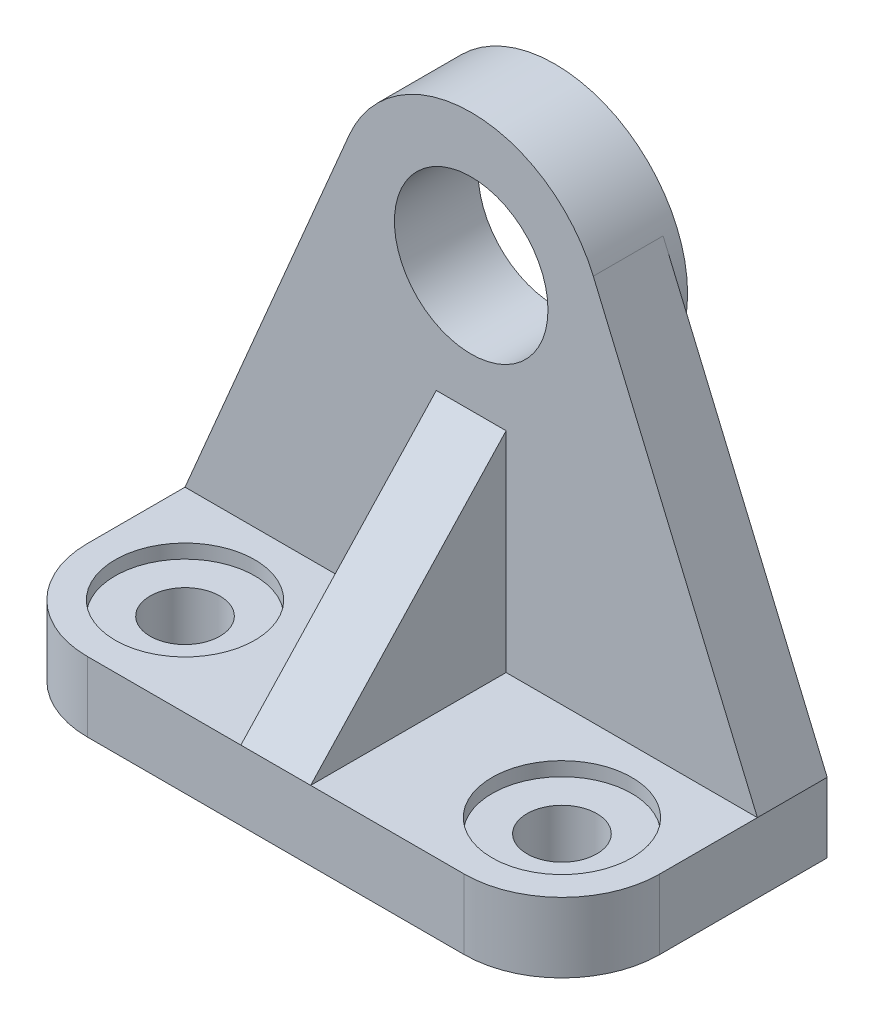
ISO-10303-21;
HEADER;
FILE_DESCRIPTION(('STEP AP214'),'2;1');
FILE_NAME('part.step','',(''),(''),'','','');
FILE_SCHEMA(('AUTOMOTIVE_DESIGN { 1 0 10303 214 1 1 1 1 }'));
ENDSEC;
DATA;
#1=APPLICATION_CONTEXT('core data for automotive mechanical design processes');
#2=APPLICATION_PROTOCOL_DEFINITION('international standard','automotive_design',2000,#1);
#3=PRODUCT_CONTEXT('',#1,'mechanical');
#4=PRODUCT('Part','Part','',(#3));
#5=PRODUCT_RELATED_PRODUCT_CATEGORY('part','',(#4));
#6=PRODUCT_DEFINITION_FORMATION('','',#4);
#7=PRODUCT_DEFINITION_CONTEXT('part definition',#1,'design');
#8=PRODUCT_DEFINITION('design','',#6,#7);
#9=PRODUCT_DEFINITION_SHAPE('','',#8);
#10=(LENGTH_UNIT() NAMED_UNIT(*) SI_UNIT(.MILLI.,.METRE.));
#11=(NAMED_UNIT(*) PLANE_ANGLE_UNIT() SI_UNIT($,.RADIAN.));
#12=(NAMED_UNIT(*) SI_UNIT($,.STERADIAN.) SOLID_ANGLE_UNIT());
#13=UNCERTAINTY_MEASURE_WITH_UNIT(LENGTH_MEASURE(1.E-05),#10,'distance_accuracy_value','');
#14=(GEOMETRIC_REPRESENTATION_CONTEXT(3) GLOBAL_UNCERTAINTY_ASSIGNED_CONTEXT((#13)) GLOBAL_UNIT_ASSIGNED_CONTEXT((#10,
#11,#12)) REPRESENTATION_CONTEXT('',''));
#15=CARTESIAN_POINT('',(0.,0.,0.));
#16=DIRECTION('',(0.,0.,1.));
#17=DIRECTION('',(1.,0.,0.));
#18=AXIS2_PLACEMENT_3D('',#15,#16,#17);
#19=CARTESIAN_POINT('',(27.,77.001,-14.));
#20=DIRECTION('',(0.,-1.,0.));
#21=DIRECTION('',(0.,0.,-1.));
#22=AXIS2_PLACEMENT_3D('',#19,#20,#21);
#23=CYLINDRICAL_SURFACE('',#22,5.);
#24=CARTESIAN_POINT('',(27.,0.,-14.));
#25=DIRECTION('',(0.,1.,0.));
#26=DIRECTION('',(0.,0.,1.));
#27=AXIS2_PLACEMENT_3D('',#24,#25,#26);
#28=CIRCLE('',#27,5.);
#29=CARTESIAN_POINT('',(27.,0.,-9.00000000000001));
#30=VERTEX_POINT('',#29);
#31=EDGE_CURVE('E243',#30,#30,#28,.T.);
#32=ORIENTED_EDGE('',*,*,#31,.F.);
#33=EDGE_LOOP('',(#32));
#34=FACE_BOUND('',#33,.T.);
#35=CARTESIAN_POINT('',(27.,7.99999999999999,-14.));
#36=DIRECTION('',(0.,1.,0.));
#37=DIRECTION('',(0.,0.,1.));
#38=AXIS2_PLACEMENT_3D('',#35,#36,#37);
#39=CIRCLE('',#38,5.);
#40=CARTESIAN_POINT('',(27.,7.99999999999999,-9.00000000000001));
#41=VERTEX_POINT('',#40);
#42=EDGE_CURVE('E67',#41,#41,#39,.T.);
#43=ORIENTED_EDGE('',*,*,#42,.T.);
#44=EDGE_LOOP('',(#43));
#45=FACE_BOUND('',#44,.T.);
#46=ADVANCED_FACE('F63',(#34,#45),#23,.F.);
#47=CARTESIAN_POINT('',(-27.,77.001,-14.));
#48=DIRECTION('',(0.,-1.,0.));
#49=DIRECTION('',(0.,0.,-1.));
#50=AXIS2_PLACEMENT_3D('',#47,#48,#49);
#51=CYLINDRICAL_SURFACE('',#50,5.);
#52=CARTESIAN_POINT('',(-27.,0.,-14.));
#53=DIRECTION('',(0.,1.,0.));
#54=DIRECTION('',(0.,0.,1.));
#55=AXIS2_PLACEMENT_3D('',#52,#53,#54);
#56=CIRCLE('',#55,5.);
#57=CARTESIAN_POINT('',(-27.,0.,-9.));
#58=VERTEX_POINT('',#57);
#59=EDGE_CURVE('E260',#58,#58,#56,.T.);
#60=ORIENTED_EDGE('',*,*,#59,.F.);
#61=EDGE_LOOP('',(#60));
#62=FACE_BOUND('',#61,.T.);
#63=CARTESIAN_POINT('',(-27.,7.99999999999999,-14.));
#64=DIRECTION('',(0.,1.,0.));
#65=DIRECTION('',(0.,0.,1.));
#66=AXIS2_PLACEMENT_3D('',#63,#64,#65);
#67=CIRCLE('',#66,5.);
#68=CARTESIAN_POINT('',(-27.,7.99999999999999,-9.));
#69=VERTEX_POINT('',#68);
#70=EDGE_CURVE('E237',#69,#69,#67,.T.);
#71=ORIENTED_EDGE('',*,*,#70,.T.);
#72=EDGE_LOOP('',(#71));
#73=FACE_BOUND('',#72,.T.);
#74=ADVANCED_FACE('F326',(#62,#73),#51,.F.);
#75=CARTESIAN_POINT('',(41.,10.,0.));
#76=DIRECTION('',(0.,-1.,0.));
#77=DIRECTION('',(0.,0.,-1.));
#78=AXIS2_PLACEMENT_3D('',#75,#76,#77);
#79=PLANE('',#78);
#80=CARTESIAN_POINT('',(-27.,10.,-14.));
#81=DIRECTION('',(0.,1.,0.));
#82=DIRECTION('',(0.,0.,1.));
#83=AXIS2_PLACEMENT_3D('',#80,#81,#82);
#84=CIRCLE('',#83,10.);
#85=CARTESIAN_POINT('',(-27.,10.,-4.));
#86=VERTEX_POINT('',#85);
#87=EDGE_CURVE('E245',#86,#86,#84,.T.);
#88=ORIENTED_EDGE('',*,*,#87,.F.);
#89=EDGE_LOOP('',(#88));
#90=FACE_BOUND('',#89,.T.);
#91=DIRECTION('',(0.,0.,1.));
#92=VECTOR('',#91,1.);
#93=CARTESIAN_POINT('',(-41.,10.,0.));
#94=LINE('',#93,#92);
#95=CARTESIAN_POINT('',(-41.,10.,-28.));
#96=VERTEX_POINT('',#95);
#97=CARTESIAN_POINT('',(-41.,10.,-14.));
#98=VERTEX_POINT('',#97);
#99=EDGE_CURVE('E197',#96,#98,#94,.T.);
#100=ORIENTED_EDGE('',*,*,#99,.T.);
#101=CARTESIAN_POINT('',(-27.,10.,-14.));
#102=DIRECTION('',(0.,-1.,0.));
#103=DIRECTION('',(0.,0.,-1.));
#104=AXIS2_PLACEMENT_3D('',#101,#102,#103);
#105=CIRCLE('',#104,14.);
#106=CARTESIAN_POINT('',(-27.,10.,0.));
#107=VERTEX_POINT('',#106);
#108=EDGE_CURVE('E72',#98,#107,#105,.F.);
#109=ORIENTED_EDGE('',*,*,#108,.T.);
#110=DIRECTION('',(-1.,0.,0.));
#111=VECTOR('',#110,1.);
#112=CARTESIAN_POINT('',(41.,10.,0.));
#113=LINE('',#112,#111);
#114=CARTESIAN_POINT('',(-5.,10.,0.));
#115=VERTEX_POINT('',#114);
#116=EDGE_CURVE('E203',#115,#107,#113,.T.);
#117=ORIENTED_EDGE('',*,*,#116,.F.);
#118=DIRECTION('',(0.,0.,-1.));
#119=VECTOR('',#118,1.);
#120=CARTESIAN_POINT('',(-5.,10.,0.));
#121=LINE('',#120,#119);
#122=CARTESIAN_POINT('',(-5.,10.,-28.));
#123=VERTEX_POINT('',#122);
#124=EDGE_CURVE('E279',#115,#123,#121,.T.);
#125=ORIENTED_EDGE('',*,*,#124,.T.);
#126=DIRECTION('',(-1.,0.,0.));
#127=VECTOR('',#126,1.);
#128=CARTESIAN_POINT('',(41.,10.,-28.));
#129=LINE('',#128,#127);
#130=EDGE_CURVE('E209',#123,#96,#129,.T.);
#131=ORIENTED_EDGE('',*,*,#130,.T.);
#132=EDGE_LOOP('',(#100,#109,#117,#125,#131));
#133=FACE_BOUND('',#132,.T.);
#134=ADVANCED_FACE('F312',(#90,#133),#79,.F.);
#135=CARTESIAN_POINT('',(41.,0.,-38.));
#136=DIRECTION('',(0.,0.,1.));
#137=DIRECTION('',(1.,0.,0.));
#138=AXIS2_PLACEMENT_3D('',#135,#136,#137);
#139=PLANE('',#138);
#140=CARTESIAN_POINT('',(0.,58.0000000000387,-38.));
#141=DIRECTION('',(0.,0.,-1.));
#142=DIRECTION('',(-1.,0.,0.));
#143=AXIS2_PLACEMENT_3D('',#140,#141,#142);
#144=CIRCLE('',#143,19.);
#145=CARTESIAN_POINT('',(17.4913668780369,65.4197092083866,-38.));
#146=VERTEX_POINT('',#145);
#147=CARTESIAN_POINT('',(-17.4913668780726,65.4197092084017,-38.));
#148=VERTEX_POINT('',#147);
#149=EDGE_CURVE('E12',#146,#148,#144,.T.);
#150=ORIENTED_EDGE('',*,*,#149,.F.);
#151=DIRECTION('',(0.390511010966473,-0.920598256740661,0.));
#152=VECTOR('',#151,1.);
#153=CARTESIAN_POINT('',(44.5950375593377,1.52498849686057,-38.));
#154=LINE('',#153,#152);
#155=CARTESIAN_POINT('',(41.,10.,-38.));
#156=VERTEX_POINT('',#155);
#157=EDGE_CURVE('E184',#146,#156,#154,.T.);
#158=ORIENTED_EDGE('',*,*,#157,.T.);
#159=DIRECTION('',(0.,1.,0.));
#160=VECTOR('',#159,1.);
#161=CARTESIAN_POINT('',(41.,0.,-38.));
#162=LINE('',#161,#160);
#163=CARTESIAN_POINT('',(41.,0.,-38.));
#164=VERTEX_POINT('',#163);
#165=EDGE_CURVE('E196',#164,#156,#162,.T.);
#166=ORIENTED_EDGE('',*,*,#165,.F.);
#167=DIRECTION('',(-1.,0.,0.));
#168=VECTOR('',#167,1.);
#169=CARTESIAN_POINT('',(41.,0.,-38.));
#170=LINE('',#169,#168);
#171=CARTESIAN_POINT('',(-41.,0.,-38.));
#172=VERTEX_POINT('',#171);
#173=EDGE_CURVE('E213',#164,#172,#170,.T.);
#174=ORIENTED_EDGE('',*,*,#173,.T.);
#175=DIRECTION('',(0.,1.,0.));
#176=VECTOR('',#175,1.);
#177=CARTESIAN_POINT('',(-41.,0.,-38.));
#178=LINE('',#177,#176);
#179=CARTESIAN_POINT('',(-41.,10.,-38.));
#180=VERTEX_POINT('',#179);
#181=EDGE_CURVE('E162',#172,#180,#178,.T.);
#182=ORIENTED_EDGE('',*,*,#181,.T.);
#183=DIRECTION('',(0.390511010966473,0.920598256740661,0.));
#184=VECTOR('',#183,1.);
#185=CARTESIAN_POINT('',(-32.090131885081,31.0042964834295,-38.));
#186=LINE('',#185,#184);
#187=EDGE_CURVE('E155',#180,#148,#186,.T.);
#188=ORIENTED_EDGE('',*,*,#187,.T.);
#189=EDGE_LOOP('',(#150,#158,#166,#174,#182,#188));
#190=FACE_BOUND('',#189,.T.);
#191=ADVANCED_FACE('F157',(#190),#139,.F.);
#192=CARTESIAN_POINT('',(41.,10.,-28.));
#193=DIRECTION('',(0.,0.,-1.));
#194=DIRECTION('',(-1.,0.,0.));
#195=AXIS2_PLACEMENT_3D('',#192,#193,#194);
#196=PLANE('',#195);
#197=CARTESIAN_POINT('',(0.,58.0000000000387,-28.));
#198=DIRECTION('',(0.,0.,1.));
#199=DIRECTION('',(1.,0.,0.));
#200=AXIS2_PLACEMENT_3D('',#197,#198,#199);
#201=CIRCLE('',#200,10.9999999999887);
#202=CARTESIAN_POINT('',(10.9999999999887,58.0000000000387,-28.));
#203=VERTEX_POINT('',#202);
#204=EDGE_CURVE('E188',#203,#203,#201,.T.);
#205=ORIENTED_EDGE('',*,*,#204,.F.);
#206=EDGE_LOOP('',(#205));
#207=FACE_BOUND('',#206,.T.);
#208=DIRECTION('',(-1.,0.,0.));
#209=VECTOR('',#208,1.);
#210=CARTESIAN_POINT('',(5.,40.,-28.));
#211=LINE('',#210,#209);
#212=CARTESIAN_POINT('',(5.,40.,-28.));
#213=VERTEX_POINT('',#212);
#214=CARTESIAN_POINT('',(-5.,40.,-28.));
#215=VERTEX_POINT('',#214);
#216=EDGE_CURVE('E276',#213,#215,#211,.T.);
#217=ORIENTED_EDGE('',*,*,#216,.F.);
#218=DIRECTION('',(0.,1.,0.));
#219=VECTOR('',#218,1.);
#220=CARTESIAN_POINT('',(5.,10.,-28.));
#221=LINE('',#220,#219);
#222=CARTESIAN_POINT('',(5.,10.,-28.));
#223=VERTEX_POINT('',#222);
#224=EDGE_CURVE('E273',#223,#213,#221,.T.);
#225=ORIENTED_EDGE('',*,*,#224,.F.);
#226=CARTESIAN_POINT('',(41.,10.,-28.));
#227=VERTEX_POINT('',#226);
#228=EDGE_CURVE('E210',#227,#223,#129,.T.);
#229=ORIENTED_EDGE('',*,*,#228,.F.);
#230=DIRECTION('',(0.390511010966473,-0.920598256740661,0.));
#231=VECTOR('',#230,1.);
#232=CARTESIAN_POINT('',(38.3425847222094,16.264642490145,-28.));
#233=LINE('',#232,#231);
#234=CARTESIAN_POINT('',(17.4913668780369,65.4197092083866,-28.));
#235=VERTEX_POINT('',#234);
#236=EDGE_CURVE('E185',#235,#227,#233,.T.);
#237=ORIENTED_EDGE('',*,*,#236,.F.);
#238=CARTESIAN_POINT('',(0.,58.0000000000387,-28.));
#239=DIRECTION('',(0.,0.,1.));
#240=DIRECTION('',(1.,0.,0.));
#241=AXIS2_PLACEMENT_3D('',#238,#239,#240);
#242=CIRCLE('',#241,18.9999999999613);
#243=CARTESIAN_POINT('',(-17.4913668780369,65.4197092083866,-28.));
#244=VERTEX_POINT('',#243);
#245=EDGE_CURVE('E181',#235,#244,#242,.T.);
#246=ORIENTED_EDGE('',*,*,#245,.T.);
#247=DIRECTION('',(0.390511010966473,0.920598256740661,0.));
#248=VECTOR('',#247,1.);
#249=CARTESIAN_POINT('',(-38.3425847222094,16.264642490145,-28.));
#250=LINE('',#249,#248);
#251=EDGE_CURVE('E172',#96,#244,#250,.T.);
#252=ORIENTED_EDGE('',*,*,#251,.F.);
#253=ORIENTED_EDGE('',*,*,#130,.F.);
#254=DIRECTION('',(0.,1.,0.));
#255=VECTOR('',#254,1.);
#256=CARTESIAN_POINT('',(-5.,10.,-28.));
#257=LINE('',#256,#255);
#258=EDGE_CURVE('E270',#123,#215,#257,.T.);
#259=ORIENTED_EDGE('',*,*,#258,.T.);
#260=EDGE_LOOP('',(#217,#225,#229,#237,#246,#252,#253,#259));
#261=FACE_BOUND('',#260,.T.);
#262=ADVANCED_FACE('F291',(#207,#261),#196,.F.);
#263=CARTESIAN_POINT('',(41.,10.,0.));
#264=DIRECTION('',(0.,0.,-1.));
#265=DIRECTION('',(-1.,0.,0.));
#266=AXIS2_PLACEMENT_3D('',#263,#264,#265);
#267=PLANE('',#266);
#268=DIRECTION('',(-1.,0.,0.));
#269=VECTOR('',#268,1.);
#270=CARTESIAN_POINT('',(41.,0.,0.));
#271=LINE('',#270,#269);
#272=CARTESIAN_POINT('',(27.,0.,0.));
#273=VERTEX_POINT('',#272);
#274=CARTESIAN_POINT('',(-27.,0.,0.));
#275=VERTEX_POINT('',#274);
#276=EDGE_CURVE('E215',#273,#275,#271,.T.);
#277=ORIENTED_EDGE('',*,*,#276,.F.);
#278=DIRECTION('',(0.,-1.,0.));
#279=VECTOR('',#278,1.);
#280=CARTESIAN_POINT('',(27.,10.,0.));
#281=LINE('',#280,#279);
#282=CARTESIAN_POINT('',(27.,10.,0.));
#283=VERTEX_POINT('',#282);
#284=EDGE_CURVE('E232',#273,#283,#281,.F.);
#285=ORIENTED_EDGE('',*,*,#284,.T.);
#286=CARTESIAN_POINT('',(5.,10.,0.));
#287=VERTEX_POINT('',#286);
#288=EDGE_CURVE('E207',#283,#287,#113,.T.);
#289=ORIENTED_EDGE('',*,*,#288,.T.);
#290=DIRECTION('',(-1.,0.,0.));
#291=VECTOR('',#290,1.);
#292=CARTESIAN_POINT('',(5.,10.,0.));
#293=LINE('',#292,#291);
#294=EDGE_CURVE('E284',#287,#115,#293,.T.);
#295=ORIENTED_EDGE('',*,*,#294,.T.);
#296=ORIENTED_EDGE('',*,*,#116,.T.);
#297=DIRECTION('',(0.,-1.,0.));
#298=VECTOR('',#297,1.);
#299=CARTESIAN_POINT('',(-27.,10.,0.));
#300=LINE('',#299,#298);
#301=EDGE_CURVE('E229',#107,#275,#300,.T.);
#302=ORIENTED_EDGE('',*,*,#301,.T.);
#303=EDGE_LOOP('',(#277,#285,#289,#295,#296,#302));
#304=FACE_BOUND('',#303,.T.);
#305=ADVANCED_FACE('F294',(#304),#267,.F.);
#306=CARTESIAN_POINT('',(41.,0.,0.));
#307=DIRECTION('',(0.,1.,0.));
#308=DIRECTION('',(0.,0.,1.));
#309=AXIS2_PLACEMENT_3D('',#306,#307,#308);
#310=PLANE('',#309);
#311=ORIENTED_EDGE('',*,*,#59,.T.);
#312=EDGE_LOOP('',(#311));
#313=FACE_BOUND('',#312,.T.);
#314=ORIENTED_EDGE('',*,*,#31,.T.);
#315=EDGE_LOOP('',(#314));
#316=FACE_BOUND('',#315,.T.);
#317=DIRECTION('',(0.,0.,-1.));
#318=VECTOR('',#317,1.);
#319=CARTESIAN_POINT('',(41.,0.,0.));
#320=LINE('',#319,#318);
#321=CARTESIAN_POINT('',(41.,0.,-14.));
#322=VERTEX_POINT('',#321);
#323=EDGE_CURVE('E194',#322,#164,#320,.T.);
#324=ORIENTED_EDGE('',*,*,#323,.F.);
#325=CARTESIAN_POINT('',(27.,0.,-14.));
#326=DIRECTION('',(0.,1.,0.));
#327=DIRECTION('',(0.,0.,1.));
#328=AXIS2_PLACEMENT_3D('',#325,#326,#327);
#329=CIRCLE('',#328,14.);
#330=EDGE_CURVE('E227',#322,#273,#329,.F.);
#331=ORIENTED_EDGE('',*,*,#330,.T.);
#332=ORIENTED_EDGE('',*,*,#276,.T.);
#333=CARTESIAN_POINT('',(-27.,0.,-14.));
#334=DIRECTION('',(0.,1.,0.));
#335=DIRECTION('',(0.,0.,1.));
#336=AXIS2_PLACEMENT_3D('',#333,#334,#335);
#337=CIRCLE('',#336,14.);
#338=CARTESIAN_POINT('',(-41.,0.,-14.));
#339=VERTEX_POINT('',#338);
#340=EDGE_CURVE('E225',#275,#339,#337,.F.);
#341=ORIENTED_EDGE('',*,*,#340,.T.);
#342=DIRECTION('',(0.,0.,-1.));
#343=VECTOR('',#342,1.);
#344=CARTESIAN_POINT('',(-41.,0.,0.));
#345=LINE('',#344,#343);
#346=EDGE_CURVE('E166',#339,#172,#345,.T.);
#347=ORIENTED_EDGE('',*,*,#346,.T.);
#348=ORIENTED_EDGE('',*,*,#173,.F.);
#349=EDGE_LOOP('',(#324,#331,#332,#341,#347,#348));
#350=FACE_BOUND('',#349,.T.);
#351=ADVANCED_FACE('F387',(#313,#316,#350),#310,.F.);
#352=CARTESIAN_POINT('',(27.,10.,-14.));
#353=DIRECTION('',(0.,1.,0.));
#354=DIRECTION('',(0.,0.,1.));
#355=AXIS2_PLACEMENT_3D('',#352,#353,#354);
#356=CIRCLE('',#355,10.);
#357=CARTESIAN_POINT('',(27.,10.,-4.));
#358=VERTEX_POINT('',#357);
#359=EDGE_CURVE('E256',#358,#358,#356,.T.);
#360=ORIENTED_EDGE('',*,*,#359,.F.);
#361=EDGE_LOOP('',(#360));
#362=FACE_BOUND('',#361,.T.);
#363=ORIENTED_EDGE('',*,*,#288,.F.);
#364=CARTESIAN_POINT('',(27.,10.,-14.));
#365=DIRECTION('',(0.,-1.,0.));
#366=DIRECTION('',(0.,0.,-1.));
#367=AXIS2_PLACEMENT_3D('',#364,#365,#366);
#368=CIRCLE('',#367,14.);
#369=CARTESIAN_POINT('',(41.,10.,-14.));
#370=VERTEX_POINT('',#369);
#371=EDGE_CURVE('E234',#283,#370,#368,.F.);
#372=ORIENTED_EDGE('',*,*,#371,.T.);
#373=DIRECTION('',(0.,0.,1.));
#374=VECTOR('',#373,1.);
#375=CARTESIAN_POINT('',(41.,10.,0.));
#376=LINE('',#375,#374);
#377=EDGE_CURVE('E200',#227,#370,#376,.T.);
#378=ORIENTED_EDGE('',*,*,#377,.F.);
#379=ORIENTED_EDGE('',*,*,#228,.T.);
#380=DIRECTION('',(0.,0.,-1.));
#381=VECTOR('',#380,1.);
#382=CARTESIAN_POINT('',(5.,10.,0.));
#383=LINE('',#382,#381);
#384=EDGE_CURVE('E269',#287,#223,#383,.T.);
#385=ORIENTED_EDGE('',*,*,#384,.F.);
#386=EDGE_LOOP('',(#363,#372,#378,#379,#385));
#387=FACE_BOUND('',#386,.T.);
#388=ADVANCED_FACE('F382',(#362,#387),#79,.F.);
#389=CARTESIAN_POINT('',(41.,0.,0.));
#390=DIRECTION('',(1.,0.,0.));
#391=DIRECTION('',(0.,0.,-1.));
#392=AXIS2_PLACEMENT_3D('',#389,#390,#391);
#393=PLANE('',#392);
#394=ORIENTED_EDGE('',*,*,#377,.T.);
#395=DIRECTION('',(0.,-1.,0.));
#396=VECTOR('',#395,1.);
#397=CARTESIAN_POINT('',(41.,0.,-14.));
#398=LINE('',#397,#396);
#399=EDGE_CURVE('E222',#370,#322,#398,.T.);
#400=ORIENTED_EDGE('',*,*,#399,.T.);
#401=ORIENTED_EDGE('',*,*,#323,.T.);
#402=ORIENTED_EDGE('',*,*,#165,.T.);
#403=DIRECTION('',(0.,0.,-1.));
#404=VECTOR('',#403,1.);
#405=CARTESIAN_POINT('',(41.,10.,0.));
#406=LINE('',#405,#404);
#407=EDGE_CURVE('E220',#227,#156,#406,.T.);
#408=ORIENTED_EDGE('',*,*,#407,.F.);
#409=EDGE_LOOP('',(#394,#400,#401,#402,#408));
#410=FACE_BOUND('',#409,.T.);
#411=ADVANCED_FACE('F379',(#410),#393,.T.);
#412=CARTESIAN_POINT('',(-41.,0.,0.));
#413=DIRECTION('',(1.,0.,0.));
#414=DIRECTION('',(0.,0.,-1.));
#415=AXIS2_PLACEMENT_3D('',#412,#413,#414);
#416=PLANE('',#415);
#417=ORIENTED_EDGE('',*,*,#346,.F.);
#418=DIRECTION('',(0.,-1.,0.));
#419=VECTOR('',#418,1.);
#420=CARTESIAN_POINT('',(-41.,0.,-14.));
#421=LINE('',#420,#419);
#422=EDGE_CURVE('E80',#339,#98,#421,.F.);
#423=ORIENTED_EDGE('',*,*,#422,.T.);
#424=ORIENTED_EDGE('',*,*,#99,.F.);
#425=DIRECTION('',(0.,0.,-1.));
#426=VECTOR('',#425,1.);
#427=CARTESIAN_POINT('',(-41.,10.,0.));
#428=LINE('',#427,#426);
#429=EDGE_CURVE('E218',#96,#180,#428,.T.);
#430=ORIENTED_EDGE('',*,*,#429,.T.);
#431=ORIENTED_EDGE('',*,*,#181,.F.);
#432=EDGE_LOOP('',(#417,#423,#424,#430,#431));
#433=FACE_BOUND('',#432,.T.);
#434=ADVANCED_FACE('F378',(#433),#416,.F.);
#435=CARTESIAN_POINT('',(0.,58.0000000000387,-110.));
#436=DIRECTION('',(0.,0.,1.));
#437=DIRECTION('',(1.,0.,0.));
#438=AXIS2_PLACEMENT_3D('',#435,#436,#437);
#439=CYLINDRICAL_SURFACE('',#438,18.9999999999613);
#440=DIRECTION('',(0.,0.,1.));
#441=VECTOR('',#440,1.);
#442=CARTESIAN_POINT('',(17.4913668780369,65.4197092083866,-110.));
#443=LINE('',#442,#441);
#444=EDGE_CURVE('E180',#146,#235,#443,.T.);
#445=ORIENTED_EDGE('',*,*,#444,.F.);
#446=ORIENTED_EDGE('',*,*,#149,.T.);
#447=DIRECTION('',(0.,0.,1.));
#448=VECTOR('',#447,1.);
#449=CARTESIAN_POINT('',(-17.4913668780369,65.4197092083866,-110.));
#450=LINE('',#449,#448);
#451=EDGE_CURVE('E167',#148,#244,#450,.T.);
#452=ORIENTED_EDGE('',*,*,#451,.T.);
#453=ORIENTED_EDGE('',*,*,#245,.F.);
#454=EDGE_LOOP('',(#445,#446,#452,#453));
#455=FACE_BOUND('',#454,.T.);
#456=CARTESIAN_POINT('',(0.,58.0000000000387,-40.));
#457=DIRECTION('',(0.,0.,-1.));
#458=DIRECTION('',(-1.,0.,0.));
#459=AXIS2_PLACEMENT_3D('',#456,#457,#458);
#460=CIRCLE('',#459,19.);
#461=CARTESIAN_POINT('',(-19.,58.0000000000387,-40.));
#462=VERTEX_POINT('',#461);
#463=EDGE_CURVE('E259',#462,#462,#460,.T.);
#464=ORIENTED_EDGE('',*,*,#463,.F.);
#465=EDGE_LOOP('',(#464));
#466=FACE_BOUND('',#465,.T.);
#467=ADVANCED_FACE('F177',(#455,#466),#439,.T.);
#468=CARTESIAN_POINT('',(-38.3425847222094,16.264642490145,-110.));
#469=DIRECTION('',(0.920598256740661,-0.390511010966473,0.));
#470=DIRECTION('',(0.390511010966473,0.920598256740661,0.));
#471=AXIS2_PLACEMENT_3D('',#468,#469,#470);
#472=PLANE('',#471);
#473=ORIENTED_EDGE('',*,*,#429,.F.);
#474=ORIENTED_EDGE('',*,*,#251,.T.);
#475=ORIENTED_EDGE('',*,*,#451,.F.);
#476=ORIENTED_EDGE('',*,*,#187,.F.);
#477=EDGE_LOOP('',(#473,#474,#475,#476));
#478=FACE_BOUND('',#477,.T.);
#479=ADVANCED_FACE('F170',(#478),#472,.F.);
#480=CARTESIAN_POINT('',(38.3425847222094,16.264642490145,-110.));
#481=DIRECTION('',(-0.920598256740661,-0.390511010966473,0.));
#482=DIRECTION('',(0.390511010966473,-0.920598256740661,0.));
#483=AXIS2_PLACEMENT_3D('',#480,#481,#482);
#484=PLANE('',#483);
#485=ORIENTED_EDGE('',*,*,#444,.T.);
#486=ORIENTED_EDGE('',*,*,#236,.T.);
#487=ORIENTED_EDGE('',*,*,#407,.T.);
#488=ORIENTED_EDGE('',*,*,#157,.F.);
#489=EDGE_LOOP('',(#485,#486,#487,#488));
#490=FACE_BOUND('',#489,.T.);
#491=ADVANCED_FACE('F366',(#490),#484,.F.);
#492=CARTESIAN_POINT('',(0.,58.0000000000387,-110.));
#493=DIRECTION('',(0.,0.,1.));
#494=DIRECTION('',(1.,0.,0.));
#495=AXIS2_PLACEMENT_3D('',#492,#493,#494);
#496=CYLINDRICAL_SURFACE('',#495,10.9999999999887);
#497=ORIENTED_EDGE('',*,*,#204,.T.);
#498=EDGE_LOOP('',(#497));
#499=FACE_BOUND('',#498,.T.);
#500=CARTESIAN_POINT('',(0.,58.0000000000387,-40.));
#501=DIRECTION('',(0.,0.,-1.));
#502=DIRECTION('',(-1.,0.,0.));
#503=AXIS2_PLACEMENT_3D('',#500,#501,#502);
#504=CIRCLE('',#503,10.9999999999887);
#505=CARTESIAN_POINT('',(-10.9999999999887,58.0000000000387,-40.));
#506=VERTEX_POINT('',#505);
#507=EDGE_CURVE('E363',#506,#506,#504,.T.);
#508=ORIENTED_EDGE('',*,*,#507,.T.);
#509=EDGE_LOOP('',(#508));
#510=FACE_BOUND('',#509,.T.);
#511=ADVANCED_FACE('F288',(#499,#510),#496,.F.);
#512=CARTESIAN_POINT('',(5.,40.,-28.));
#513=DIRECTION('',(0.,-0.682318250360011,-0.731055268242869));
#514=DIRECTION('',(0.,0.731055268242869,-0.682318250360011));
#515=AXIS2_PLACEMENT_3D('',#512,#513,#514);
#516=PLANE('',#515);
#517=DIRECTION('',(0.,-0.731055268242869,0.682318250360011));
#518=VECTOR('',#517,1.);
#519=CARTESIAN_POINT('',(-5.,40.,-28.));
#520=LINE('',#519,#518);
#521=EDGE_CURVE('E263',#215,#115,#520,.T.);
#522=ORIENTED_EDGE('',*,*,#521,.T.);
#523=ORIENTED_EDGE('',*,*,#294,.F.);
#524=DIRECTION('',(0.,-0.731055268242869,0.682318250360011));
#525=VECTOR('',#524,1.);
#526=CARTESIAN_POINT('',(5.,40.,-28.));
#527=LINE('',#526,#525);
#528=EDGE_CURVE('E266',#213,#287,#527,.T.);
#529=ORIENTED_EDGE('',*,*,#528,.F.);
#530=ORIENTED_EDGE('',*,*,#216,.T.);
#531=EDGE_LOOP('',(#522,#523,#529,#530));
#532=FACE_BOUND('',#531,.T.);
#533=ADVANCED_FACE('F306',(#532),#516,.F.);
#534=CARTESIAN_POINT('',(5.,0.,0.));
#535=DIRECTION('',(1.,0.,0.));
#536=DIRECTION('',(0.,0.,-1.));
#537=AXIS2_PLACEMENT_3D('',#534,#535,#536);
#538=PLANE('',#537);
#539=ORIENTED_EDGE('',*,*,#528,.T.);
#540=ORIENTED_EDGE('',*,*,#384,.T.);
#541=ORIENTED_EDGE('',*,*,#224,.T.);
#542=EDGE_LOOP('',(#539,#540,#541));
#543=FACE_BOUND('',#542,.T.);
#544=ADVANCED_FACE('F303',(#543),#538,.T.);
#545=CARTESIAN_POINT('',(-5.,0.,0.));
#546=DIRECTION('',(1.,0.,0.));
#547=DIRECTION('',(0.,0.,-1.));
#548=AXIS2_PLACEMENT_3D('',#545,#546,#547);
#549=PLANE('',#548);
#550=ORIENTED_EDGE('',*,*,#521,.F.);
#551=ORIENTED_EDGE('',*,*,#258,.F.);
#552=ORIENTED_EDGE('',*,*,#124,.F.);
#553=EDGE_LOOP('',(#550,#551,#552));
#554=FACE_BOUND('',#553,.T.);
#555=ADVANCED_FACE('F314',(#554),#549,.F.);
#556=CARTESIAN_POINT('',(27.,0.,-14.));
#557=DIRECTION('',(0.,1.,0.));
#558=DIRECTION('',(0.,0.,1.));
#559=AXIS2_PLACEMENT_3D('',#556,#557,#558);
#560=CYLINDRICAL_SURFACE('',#559,14.);
#561=ORIENTED_EDGE('',*,*,#371,.F.);
#562=ORIENTED_EDGE('',*,*,#284,.F.);
#563=ORIENTED_EDGE('',*,*,#330,.F.);
#564=ORIENTED_EDGE('',*,*,#399,.F.);
#565=EDGE_LOOP('',(#561,#562,#563,#564));
#566=FACE_BOUND('',#565,.T.);
#567=ADVANCED_FACE('F316',(#566),#560,.T.);
#568=CARTESIAN_POINT('',(-27.,10.,-14.));
#569=DIRECTION('',(0.,-1.,0.));
#570=DIRECTION('',(0.,0.,-1.));
#571=AXIS2_PLACEMENT_3D('',#568,#569,#570);
#572=CYLINDRICAL_SURFACE('',#571,14.);
#573=ORIENTED_EDGE('',*,*,#108,.F.);
#574=ORIENTED_EDGE('',*,*,#422,.F.);
#575=ORIENTED_EDGE('',*,*,#340,.F.);
#576=ORIENTED_EDGE('',*,*,#301,.F.);
#577=EDGE_LOOP('',(#573,#574,#575,#576));
#578=FACE_BOUND('',#577,.T.);
#579=ADVANCED_FACE('F65',(#578),#572,.T.);
#580=CARTESIAN_POINT('',(-27.,8.,-14.));
#581=DIRECTION('',(0.,1.,0.));
#582=DIRECTION('',(0.,0.,1.));
#583=AXIS2_PLACEMENT_3D('',#580,#581,#582);
#584=CYLINDRICAL_SURFACE('',#583,10.);
#585=CARTESIAN_POINT('',(-27.,8.,-14.));
#586=DIRECTION('',(0.,1.,0.));
#587=DIRECTION('',(0.,0.,1.));
#588=AXIS2_PLACEMENT_3D('',#585,#586,#587);
#589=CIRCLE('',#588,10.);
#590=CARTESIAN_POINT('',(-27.,8.,-4.));
#591=VERTEX_POINT('',#590);
#592=EDGE_CURVE('E239',#591,#591,#589,.T.);
#593=ORIENTED_EDGE('',*,*,#592,.F.);
#594=EDGE_LOOP('',(#593));
#595=FACE_BOUND('',#594,.T.);
#596=ORIENTED_EDGE('',*,*,#87,.T.);
#597=EDGE_LOOP('',(#596));
#598=FACE_BOUND('',#597,.T.);
#599=ADVANCED_FACE('F347',(#595,#598),#584,.F.);
#600=CARTESIAN_POINT('',(-27.,8.,-14.));
#601=DIRECTION('',(0.,1.,0.));
#602=DIRECTION('',(0.,0.,1.));
#603=AXIS2_PLACEMENT_3D('',#600,#601,#602);
#604=PLANE('',#603);
#605=ORIENTED_EDGE('',*,*,#70,.F.);
#606=EDGE_LOOP('',(#605));
#607=FACE_BOUND('',#606,.T.);
#608=ORIENTED_EDGE('',*,*,#592,.T.);
#609=EDGE_LOOP('',(#608));
#610=FACE_BOUND('',#609,.T.);
#611=ADVANCED_FACE('F341',(#607,#610),#604,.T.);
#612=CARTESIAN_POINT('',(27.,8.,-14.));
#613=DIRECTION('',(0.,1.,0.));
#614=DIRECTION('',(0.,0.,1.));
#615=AXIS2_PLACEMENT_3D('',#612,#613,#614);
#616=CYLINDRICAL_SURFACE('',#615,10.);
#617=CARTESIAN_POINT('',(27.,8.,-14.));
#618=DIRECTION('',(0.,1.,0.));
#619=DIRECTION('',(0.,0.,1.));
#620=AXIS2_PLACEMENT_3D('',#617,#618,#619);
#621=CIRCLE('',#620,10.);
#622=CARTESIAN_POINT('',(27.,8.,-4.));
#623=VERTEX_POINT('',#622);
#624=EDGE_CURVE('E250',#623,#623,#621,.T.);
#625=ORIENTED_EDGE('',*,*,#624,.F.);
#626=EDGE_LOOP('',(#625));
#627=FACE_BOUND('',#626,.T.);
#628=ORIENTED_EDGE('',*,*,#359,.T.);
#629=EDGE_LOOP('',(#628));
#630=FACE_BOUND('',#629,.T.);
#631=ADVANCED_FACE('F337',(#627,#630),#616,.F.);
#632=CARTESIAN_POINT('',(27.,8.,-14.));
#633=DIRECTION('',(0.,1.,0.));
#634=DIRECTION('',(0.,0.,1.));
#635=AXIS2_PLACEMENT_3D('',#632,#633,#634);
#636=PLANE('',#635);
#637=ORIENTED_EDGE('',*,*,#42,.F.);
#638=EDGE_LOOP('',(#637));
#639=FACE_BOUND('',#638,.T.);
#640=ORIENTED_EDGE('',*,*,#624,.T.);
#641=EDGE_LOOP('',(#640));
#642=FACE_BOUND('',#641,.T.);
#643=ADVANCED_FACE('F340',(#639,#642),#636,.T.);
#644=CARTESIAN_POINT('',(0.,58.0000000000387,-40.));
#645=DIRECTION('',(0.,0.,-1.));
#646=DIRECTION('',(-1.,0.,0.));
#647=AXIS2_PLACEMENT_3D('',#644,#645,#646);
#648=PLANE('',#647);
#649=ORIENTED_EDGE('',*,*,#463,.T.);
#650=EDGE_LOOP('',(#649));
#651=FACE_BOUND('',#650,.T.);
#652=ORIENTED_EDGE('',*,*,#507,.F.);
#653=EDGE_LOOP('',(#652));
#654=FACE_BOUND('',#653,.T.);
#655=ADVANCED_FACE('F345',(#651,#654),#648,.T.);
#656=CLOSED_SHELL('',(#46,#74,#134,#191,#262,#305,#351,#388,#411,#434,#467,#479,#491,#511,#533,
#544,#555,#567,#579,#599,#611,#631,#643,#655));
#657=MANIFOLD_SOLID_BREP('B2',#656);
#658=ADVANCED_BREP_SHAPE_REPRESENTATION('',(#18,#657),#14);
#659=SHAPE_DEFINITION_REPRESENTATION(#9,#658);
ENDSEC;
END-ISO-10303-21;
